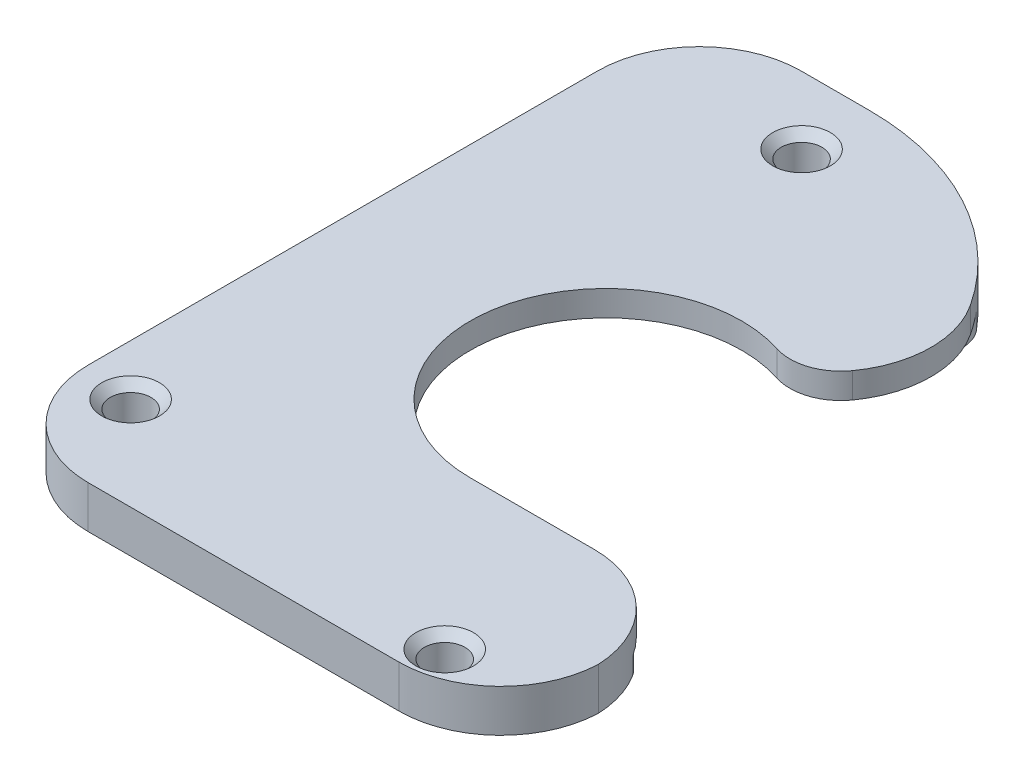
ISO-10303-21;
HEADER;
FILE_DESCRIPTION(('STEP AP214'),'2;1');
FILE_NAME('part.step','',(''),(''),'','','');
FILE_SCHEMA(('AUTOMOTIVE_DESIGN { 1 0 10303 214 1 1 1 1 }'));
ENDSEC;
DATA;
#1=APPLICATION_CONTEXT('core data for automotive mechanical design processes');
#2=APPLICATION_PROTOCOL_DEFINITION('international standard','automotive_design',2000,#1);
#3=PRODUCT_CONTEXT('',#1,'mechanical');
#4=PRODUCT('Part','Part','',(#3));
#5=PRODUCT_RELATED_PRODUCT_CATEGORY('part','',(#4));
#6=PRODUCT_DEFINITION_FORMATION('','',#4);
#7=PRODUCT_DEFINITION_CONTEXT('part definition',#1,'design');
#8=PRODUCT_DEFINITION('design','',#6,#7);
#9=PRODUCT_DEFINITION_SHAPE('','',#8);
#10=(LENGTH_UNIT() NAMED_UNIT(*) SI_UNIT(.MILLI.,.METRE.));
#11=(NAMED_UNIT(*) PLANE_ANGLE_UNIT() SI_UNIT($,.RADIAN.));
#12=(NAMED_UNIT(*) SI_UNIT($,.STERADIAN.) SOLID_ANGLE_UNIT());
#13=UNCERTAINTY_MEASURE_WITH_UNIT(LENGTH_MEASURE(1.E-05),#10,'distance_accuracy_value','');
#14=(GEOMETRIC_REPRESENTATION_CONTEXT(3) GLOBAL_UNCERTAINTY_ASSIGNED_CONTEXT((#13)) GLOBAL_UNIT_ASSIGNED_CONTEXT((#10,
#11,#12)) REPRESENTATION_CONTEXT('',''));
#15=CARTESIAN_POINT('',(0.,0.,0.));
#16=DIRECTION('',(0.,0.,1.));
#17=DIRECTION('',(1.,0.,0.));
#18=AXIS2_PLACEMENT_3D('',#15,#16,#17);
#19=CARTESIAN_POINT('',(0.,2.5,8.));
#20=DIRECTION('',(0.,0.,1.));
#21=DIRECTION('',(1.,0.,0.));
#22=AXIS2_PLACEMENT_3D('',#19,#20,#21);
#23=PLANE('',#22);
#24=DIRECTION('',(1.,0.,0.));
#25=VECTOR('',#24,1.);
#26=CARTESIAN_POINT('',(0.,1.,8.));
#27=LINE('',#26,#25);
#28=CARTESIAN_POINT('',(0.,1.,8.));
#29=VERTEX_POINT('',#28);
#30=CARTESIAN_POINT('',(7.30000000000001,1.,8.));
#31=VERTEX_POINT('',#30);
#32=EDGE_CURVE('E169',#29,#31,#27,.T.);
#33=ORIENTED_EDGE('',*,*,#32,.F.);
#34=DIRECTION('',(0.,-1.,0.));
#35=VECTOR('',#34,1.);
#36=CARTESIAN_POINT('',(0.,2.5,8.));
#37=LINE('',#36,#35);
#38=CARTESIAN_POINT('',(0.,2.5,8.));
#39=VERTEX_POINT('',#38);
#40=EDGE_CURVE('E168',#39,#29,#37,.T.);
#41=ORIENTED_EDGE('',*,*,#40,.F.);
#42=DIRECTION('',(-1.,0.,0.));
#43=VECTOR('',#42,1.);
#44=CARTESIAN_POINT('',(0.,2.5,8.));
#45=LINE('',#44,#43);
#46=CARTESIAN_POINT('',(7.30000000000001,2.5,8.));
#47=VERTEX_POINT('',#46);
#48=EDGE_CURVE('E310',#47,#39,#45,.T.);
#49=ORIENTED_EDGE('',*,*,#48,.F.);
#50=DIRECTION('',(0.,-1.,0.));
#51=VECTOR('',#50,1.);
#52=CARTESIAN_POINT('',(7.30000000000001,2.5,8.));
#53=LINE('',#52,#51);
#54=EDGE_CURVE('E360',#47,#31,#53,.T.);
#55=ORIENTED_EDGE('',*,*,#54,.T.);
#56=EDGE_LOOP('',(#33,#41,#49,#55));
#57=FACE_BOUND('',#56,.T.);
#58=ADVANCED_FACE('F37',(#57),#23,.F.);
#59=CARTESIAN_POINT('',(0.,2.5,0.));
#60=DIRECTION('',(0.,-1.,0.));
#61=DIRECTION('',(0.,0.,-1.));
#62=AXIS2_PLACEMENT_3D('',#59,#60,#61);
#63=CYLINDRICAL_SURFACE('',#62,8.);
#64=CARTESIAN_POINT('',(0.,1.,0.));
#65=DIRECTION('',(0.,-1.,0.));
#66=DIRECTION('',(0.,0.,-1.));
#67=AXIS2_PLACEMENT_3D('',#64,#65,#66);
#68=CIRCLE('',#67,8.);
#69=CARTESIAN_POINT('',(2.44412412371612,1.,-7.6174967848939));
#70=VERTEX_POINT('',#69);
#71=EDGE_CURVE('E153',#70,#29,#68,.F.);
#72=ORIENTED_EDGE('',*,*,#71,.F.);
#73=DIRECTION('',(0.,-1.,0.));
#74=VECTOR('',#73,1.);
#75=CARTESIAN_POINT('',(2.44412412371612,2.5,-7.6174967848939));
#76=LINE('',#75,#74);
#77=CARTESIAN_POINT('',(2.44412412371612,2.5,-7.6174967848939));
#78=VERTEX_POINT('',#77);
#79=EDGE_CURVE('E165',#70,#78,#76,.F.);
#80=ORIENTED_EDGE('',*,*,#79,.T.);
#81=CARTESIAN_POINT('',(0.,2.5,0.));
#82=DIRECTION('',(0.,-1.,0.));
#83=DIRECTION('',(0.,0.,1.));
#84=AXIS2_PLACEMENT_3D('',#81,#82,#83);
#85=CIRCLE('',#84,8.);
#86=EDGE_CURVE('E312',#39,#78,#85,.T.);
#87=ORIENTED_EDGE('',*,*,#86,.F.);
#88=ORIENTED_EDGE('',*,*,#40,.T.);
#89=EDGE_LOOP('',(#72,#80,#87,#88));
#90=FACE_BOUND('',#89,.T.);
#91=ADVANCED_FACE('F163',(#90),#63,.F.);
#92=CARTESIAN_POINT('',(3.36067067010967,2.5,-10.4740580792291));
#93=DIRECTION('',(0.,1.,0.));
#94=DIRECTION('',(0.,0.,1.));
#95=AXIS2_PLACEMENT_3D('',#92,#93,#94);
#96=CYLINDRICAL_SURFACE('',#95,3.);
#97=ORIENTED_EDGE('',*,*,#79,.F.);
#98=CARTESIAN_POINT('',(3.36067067010967,1.,-10.4740580792291));
#99=DIRECTION('',(0.,-1.,0.));
#100=DIRECTION('',(0.,0.,-1.));
#101=AXIS2_PLACEMENT_3D('',#98,#99,#100);
#102=CIRCLE('',#101,3.);
#103=CARTESIAN_POINT('',(5.79591698377834,1.,-8.72203770498594));
#104=VERTEX_POINT('',#103);
#105=EDGE_CURVE('E150',#70,#104,#102,.F.);
#106=ORIENTED_EDGE('',*,*,#105,.T.);
#107=DIRECTION('',(0.,1.,0.));
#108=VECTOR('',#107,1.);
#109=CARTESIAN_POINT('',(5.79591698377834,2.5,-8.72203770498594));
#110=LINE('',#109,#108);
#111=CARTESIAN_POINT('',(5.79591698377834,2.5,-8.72203770498594));
#112=VERTEX_POINT('',#111);
#113=EDGE_CURVE('E173',#112,#104,#110,.F.);
#114=ORIENTED_EDGE('',*,*,#113,.F.);
#115=CARTESIAN_POINT('',(3.36067067010967,2.5,-10.4740580792291));
#116=DIRECTION('',(0.,1.,0.));
#117=DIRECTION('',(0.,0.,1.));
#118=AXIS2_PLACEMENT_3D('',#115,#116,#117);
#119=CIRCLE('',#118,3.);
#120=EDGE_CURVE('E159',#78,#112,#119,.T.);
#121=ORIENTED_EDGE('',*,*,#120,.F.);
#122=EDGE_LOOP('',(#97,#106,#114,#121));
#123=FACE_BOUND('',#122,.T.);
#124=ADVANCED_FACE('F172',(#123),#96,.T.);
#125=CARTESIAN_POINT('',(-7.,2.5,-7.01471163744065));
#126=DIRECTION('',(0.,-1.,0.));
#127=DIRECTION('',(0.,0.,-1.));
#128=AXIS2_PLACEMENT_3D('',#125,#126,#127);
#129=CYLINDRICAL_SURFACE('',#128,15.4852883625594);
#130=DIRECTION('',(0.,-1.,0.));
#131=VECTOR('',#130,1.);
#132=CARTESIAN_POINT('',(5.93871908413183,2.5,-15.5225729511633));
#133=LINE('',#132,#131);
#134=CARTESIAN_POINT('',(5.93871908413183,2.5,-15.5225729511633));
#135=VERTEX_POINT('',#134);
#136=CARTESIAN_POINT('',(5.93871908413183,1.,-15.5225729511633));
#137=VERTEX_POINT('',#136);
#138=EDGE_CURVE('E339',#135,#137,#133,.T.);
#139=ORIENTED_EDGE('',*,*,#138,.T.);
#140=CARTESIAN_POINT('',(-7.,1.,-7.01471163744065));
#141=DIRECTION('',(0.,-1.,0.));
#142=DIRECTION('',(0.,0.,-1.));
#143=AXIS2_PLACEMENT_3D('',#140,#141,#142);
#144=CIRCLE('',#143,15.4852883625594);
#145=CARTESIAN_POINT('',(4.90136228982585,1.,-16.9218671988481));
#146=VERTEX_POINT('',#145);
#147=EDGE_CURVE('E194',#137,#146,#144,.F.);
#148=ORIENTED_EDGE('',*,*,#147,.T.);
#149=DIRECTION('',(0.,-1.,0.));
#150=VECTOR('',#149,1.);
#151=CARTESIAN_POINT('',(4.90136228982585,2.5,-16.9218671988481));
#152=LINE('',#151,#150);
#153=CARTESIAN_POINT('',(4.90136228982585,0.,-16.9218671988481));
#154=VERTEX_POINT('',#153);
#155=EDGE_CURVE('E192',#146,#154,#152,.T.);
#156=ORIENTED_EDGE('',*,*,#155,.T.);
#157=CARTESIAN_POINT('',(-7.,0.,-7.01471163744065));
#158=DIRECTION('',(0.,1.,0.));
#159=DIRECTION('',(0.,0.,1.));
#160=AXIS2_PLACEMENT_3D('',#157,#158,#159);
#161=CIRCLE('',#160,15.4852883625594);
#162=CARTESIAN_POINT('',(-7.,0.,-22.5));
#163=VERTEX_POINT('',#162);
#164=EDGE_CURVE('E287',#154,#163,#161,.T.);
#165=ORIENTED_EDGE('',*,*,#164,.T.);
#166=DIRECTION('',(0.,-1.,0.));
#167=VECTOR('',#166,1.);
#168=CARTESIAN_POINT('',(-7.,2.5,-22.5));
#169=LINE('',#168,#167);
#170=CARTESIAN_POINT('',(-7.,2.5,-22.5));
#171=VERTEX_POINT('',#170);
#172=EDGE_CURVE('E326',#171,#163,#169,.T.);
#173=ORIENTED_EDGE('',*,*,#172,.F.);
#174=CARTESIAN_POINT('',(-7.,2.5,-7.01471163744065));
#175=DIRECTION('',(0.,1.,0.));
#176=DIRECTION('',(0.,0.,1.));
#177=AXIS2_PLACEMENT_3D('',#174,#175,#176);
#178=CIRCLE('',#177,15.4852883625594);
#179=EDGE_CURVE('E315',#135,#171,#178,.T.);
#180=ORIENTED_EDGE('',*,*,#179,.F.);
#181=EDGE_LOOP('',(#139,#148,#156,#165,#173,#180));
#182=FACE_BOUND('',#181,.T.);
#183=ADVANCED_FACE('F261',(#182),#129,.T.);
#184=CARTESIAN_POINT('',(-17.,2.5,-22.5));
#185=DIRECTION('',(0.,0.,1.));
#186=DIRECTION('',(1.,0.,0.));
#187=AXIS2_PLACEMENT_3D('',#184,#185,#186);
#188=PLANE('',#187);
#189=DIRECTION('',(-1.,0.,0.));
#190=VECTOR('',#189,1.);
#191=CARTESIAN_POINT('',(-17.,0.,-22.5));
#192=LINE('',#191,#190);
#193=CARTESIAN_POINT('',(-11.,0.,-22.5));
#194=VERTEX_POINT('',#193);
#195=EDGE_CURVE('E328',#163,#194,#192,.T.);
#196=ORIENTED_EDGE('',*,*,#195,.T.);
#197=DIRECTION('',(0.,-1.,0.));
#198=VECTOR('',#197,1.);
#199=CARTESIAN_POINT('',(-11.,2.5,-22.5));
#200=LINE('',#199,#198);
#201=CARTESIAN_POINT('',(-11.,2.5,-22.5));
#202=VERTEX_POINT('',#201);
#203=EDGE_CURVE('E176',#194,#202,#200,.F.);
#204=ORIENTED_EDGE('',*,*,#203,.T.);
#205=DIRECTION('',(-1.,0.,0.));
#206=VECTOR('',#205,1.);
#207=CARTESIAN_POINT('',(-17.,2.5,-22.5));
#208=LINE('',#207,#206);
#209=EDGE_CURVE('E317',#171,#202,#208,.T.);
#210=ORIENTED_EDGE('',*,*,#209,.F.);
#211=ORIENTED_EDGE('',*,*,#172,.T.);
#212=EDGE_LOOP('',(#196,#204,#210,#211));
#213=FACE_BOUND('',#212,.T.);
#214=ADVANCED_FACE('F397',(#213),#188,.F.);
#215=CARTESIAN_POINT('',(-17.,2.5,-22.5));
#216=DIRECTION('',(1.,0.,0.));
#217=DIRECTION('',(0.,0.,-1.));
#218=AXIS2_PLACEMENT_3D('',#215,#216,#217);
#219=PLANE('',#218);
#220=DIRECTION('',(0.,0.,1.));
#221=VECTOR('',#220,1.);
#222=CARTESIAN_POINT('',(-17.,2.5,-22.5));
#223=LINE('',#222,#221);
#224=CARTESIAN_POINT('',(-17.,2.5,-16.5));
#225=VERTEX_POINT('',#224);
#226=CARTESIAN_POINT('',(-17.,2.5,13.5));
#227=VERTEX_POINT('',#226);
#228=EDGE_CURVE('E320',#225,#227,#223,.T.);
#229=ORIENTED_EDGE('',*,*,#228,.F.);
#230=DIRECTION('',(0.,-1.,0.));
#231=VECTOR('',#230,1.);
#232=CARTESIAN_POINT('',(-17.,2.5,-16.5));
#233=LINE('',#232,#231);
#234=CARTESIAN_POINT('',(-17.,0.,-16.5));
#235=VERTEX_POINT('',#234);
#236=EDGE_CURVE('E370',#225,#235,#233,.T.);
#237=ORIENTED_EDGE('',*,*,#236,.T.);
#238=DIRECTION('',(0.,0.,1.));
#239=VECTOR('',#238,1.);
#240=CARTESIAN_POINT('',(-17.,0.,-22.5));
#241=LINE('',#240,#239);
#242=CARTESIAN_POINT('',(-17.,0.,13.5));
#243=VERTEX_POINT('',#242);
#244=EDGE_CURVE('E331',#235,#243,#241,.T.);
#245=ORIENTED_EDGE('',*,*,#244,.T.);
#246=DIRECTION('',(0.,-1.,0.));
#247=VECTOR('',#246,1.);
#248=CARTESIAN_POINT('',(-17.,2.5,13.5));
#249=LINE('',#248,#247);
#250=EDGE_CURVE('E368',#243,#227,#249,.F.);
#251=ORIENTED_EDGE('',*,*,#250,.T.);
#252=EDGE_LOOP('',(#229,#237,#245,#251));
#253=FACE_BOUND('',#252,.T.);
#254=ADVANCED_FACE('F392',(#253),#219,.F.);
#255=CARTESIAN_POINT('',(-17.,2.5,19.5));
#256=DIRECTION('',(0.,0.,-1.));
#257=DIRECTION('',(-1.,0.,0.));
#258=AXIS2_PLACEMENT_3D('',#255,#256,#257);
#259=PLANE('',#258);
#260=DIRECTION('',(1.,0.,0.));
#261=VECTOR('',#260,1.);
#262=CARTESIAN_POINT('',(-17.,0.,19.5));
#263=LINE('',#262,#261);
#264=CARTESIAN_POINT('',(-11.,0.,19.5));
#265=VERTEX_POINT('',#264);
#266=CARTESIAN_POINT('',(7.3,0.,19.5));
#267=VERTEX_POINT('',#266);
#268=EDGE_CURVE('E313',#265,#267,#263,.T.);
#269=ORIENTED_EDGE('',*,*,#268,.T.);
#270=DIRECTION('',(0.,-1.,0.));
#271=VECTOR('',#270,1.);
#272=CARTESIAN_POINT('',(7.30000000000001,2.5,19.5));
#273=LINE('',#272,#271);
#274=CARTESIAN_POINT('',(7.3,2.5,19.5));
#275=VERTEX_POINT('',#274);
#276=EDGE_CURVE('E366',#267,#275,#273,.F.);
#277=ORIENTED_EDGE('',*,*,#276,.T.);
#278=DIRECTION('',(1.,0.,0.));
#279=VECTOR('',#278,1.);
#280=CARTESIAN_POINT('',(-17.,2.5,19.5));
#281=LINE('',#280,#279);
#282=CARTESIAN_POINT('',(-11.,2.5,19.5));
#283=VERTEX_POINT('',#282);
#284=EDGE_CURVE('E323',#283,#275,#281,.T.);
#285=ORIENTED_EDGE('',*,*,#284,.F.);
#286=DIRECTION('',(0.,-1.,0.));
#287=VECTOR('',#286,1.);
#288=CARTESIAN_POINT('',(-11.,2.5,19.5));
#289=LINE('',#288,#287);
#290=EDGE_CURVE('E363',#283,#265,#289,.T.);
#291=ORIENTED_EDGE('',*,*,#290,.T.);
#292=EDGE_LOOP('',(#269,#277,#285,#291));
#293=FACE_BOUND('',#292,.T.);
#294=ADVANCED_FACE('F384',(#293),#259,.F.);
#295=CARTESIAN_POINT('',(-7.,2.5,-7.01471163744065));
#296=DIRECTION('',(0.,1.,0.));
#297=DIRECTION('',(0.,0.,1.));
#298=AXIS2_PLACEMENT_3D('',#295,#296,#297);
#299=PLANE('',#298);
#300=CARTESIAN_POINT('',(8.,2.5,17.5));
#301=DIRECTION('',(0.,1.,0.));
#302=DIRECTION('',(0.,0.,1.));
#303=AXIS2_PLACEMENT_3D('',#300,#301,#302);
#304=CIRCLE('',#303,1.70000000000001);
#305=CARTESIAN_POINT('',(8.,2.5,19.2));
#306=VERTEX_POINT('',#305);
#307=EDGE_CURVE('E208',#306,#306,#304,.F.);
#308=ORIENTED_EDGE('',*,*,#307,.T.);
#309=EDGE_LOOP('',(#308));
#310=FACE_BOUND('',#309,.T.);
#311=CARTESIAN_POINT('',(-14.,2.5,14.));
#312=DIRECTION('',(0.,1.,0.));
#313=DIRECTION('',(0.,0.,1.));
#314=AXIS2_PLACEMENT_3D('',#311,#312,#313);
#315=CIRCLE('',#314,1.70000000000001);
#316=CARTESIAN_POINT('',(-14.,2.5,15.7));
#317=VERTEX_POINT('',#316);
#318=EDGE_CURVE('E205',#317,#317,#315,.F.);
#319=ORIENTED_EDGE('',*,*,#318,.T.);
#320=EDGE_LOOP('',(#319));
#321=FACE_BOUND('',#320,.T.);
#322=CARTESIAN_POINT('',(-7.,2.5,-18.5213390444644));
#323=DIRECTION('',(0.,1.,0.));
#324=DIRECTION('',(0.,0.,1.));
#325=AXIS2_PLACEMENT_3D('',#322,#323,#324);
#326=CIRCLE('',#325,1.70000000000001);
#327=CARTESIAN_POINT('',(-7.,2.5,-16.8213390444644));
#328=VERTEX_POINT('',#327);
#329=EDGE_CURVE('E202',#328,#328,#326,.F.);
#330=ORIENTED_EDGE('',*,*,#329,.T.);
#331=EDGE_LOOP('',(#330));
#332=FACE_BOUND('',#331,.T.);
#333=ORIENTED_EDGE('',*,*,#86,.T.);
#334=ORIENTED_EDGE('',*,*,#120,.T.);
#335=CARTESIAN_POINT('',(0.925424356441002,2.5,-12.2260784534723));
#336=DIRECTION('',(0.,1.,0.));
#337=DIRECTION('',(0.,0.,1.));
#338=AXIS2_PLACEMENT_3D('',#335,#336,#337);
#339=CIRCLE('',#338,6.);
#340=EDGE_CURVE('E358',#112,#135,#339,.T.);
#341=ORIENTED_EDGE('',*,*,#340,.T.);
#342=ORIENTED_EDGE('',*,*,#179,.T.);
#343=ORIENTED_EDGE('',*,*,#209,.T.);
#344=CARTESIAN_POINT('',(-11.,2.5,-16.5));
#345=DIRECTION('',(0.,1.,0.));
#346=DIRECTION('',(0.,0.,1.));
#347=AXIS2_PLACEMENT_3D('',#344,#345,#346);
#348=CIRCLE('',#347,6.);
#349=EDGE_CURVE('E352',#202,#225,#348,.T.);
#350=ORIENTED_EDGE('',*,*,#349,.T.);
#351=ORIENTED_EDGE('',*,*,#228,.T.);
#352=CARTESIAN_POINT('',(-11.,2.5,13.5));
#353=DIRECTION('',(0.,1.,0.));
#354=DIRECTION('',(0.,0.,1.));
#355=AXIS2_PLACEMENT_3D('',#352,#353,#354);
#356=CIRCLE('',#355,6.);
#357=EDGE_CURVE('E350',#227,#283,#356,.T.);
#358=ORIENTED_EDGE('',*,*,#357,.T.);
#359=ORIENTED_EDGE('',*,*,#284,.T.);
#360=CARTESIAN_POINT('',(7.30000000000001,2.5,13.5));
#361=DIRECTION('',(0.,1.,0.));
#362=DIRECTION('',(0.,0.,1.));
#363=AXIS2_PLACEMENT_3D('',#360,#361,#362);
#364=CIRCLE('',#363,6.);
#365=CARTESIAN_POINT('',(13.2947894041409,2.5,13.75));
#366=VERTEX_POINT('',#365);
#367=EDGE_CURVE('E354',#275,#366,#364,.T.);
#368=ORIENTED_EDGE('',*,*,#367,.T.);
#369=CARTESIAN_POINT('',(7.30000000000001,2.5,14.));
#370=DIRECTION('',(0.,1.,0.));
#371=DIRECTION('',(0.,0.,1.));
#372=AXIS2_PLACEMENT_3D('',#369,#370,#371);
#373=CIRCLE('',#372,6.);
#374=EDGE_CURVE('E356',#366,#47,#373,.T.);
#375=ORIENTED_EDGE('',*,*,#374,.T.);
#376=ORIENTED_EDGE('',*,*,#48,.T.);
#377=EDGE_LOOP('',(#333,#334,#341,#342,#343,#350,#351,#358,#359,#368,#375,#376));
#378=FACE_BOUND('',#377,.T.);
#379=ADVANCED_FACE('F404',(#310,#321,#332,#378),#299,.T.);
#380=CARTESIAN_POINT('',(-7.,0.,-7.01471163744065));
#381=DIRECTION('',(0.,1.,0.));
#382=DIRECTION('',(0.,0.,1.));
#383=AXIS2_PLACEMENT_3D('',#380,#381,#382);
#384=PLANE('',#383);
#385=CARTESIAN_POINT('',(-14.,0.,14.));
#386=DIRECTION('',(0.,1.,0.));
#387=DIRECTION('',(0.,0.,1.));
#388=AXIS2_PLACEMENT_3D('',#385,#386,#387);
#389=CIRCLE('',#388,1.2);
#390=CARTESIAN_POINT('',(-14.,0.,15.2));
#391=VERTEX_POINT('',#390);
#392=EDGE_CURVE('E301',#391,#391,#389,.T.);
#393=ORIENTED_EDGE('',*,*,#392,.T.);
#394=EDGE_LOOP('',(#393));
#395=FACE_BOUND('',#394,.T.);
#396=CARTESIAN_POINT('',(-7.,0.,-18.5213390444644));
#397=DIRECTION('',(0.,1.,0.));
#398=DIRECTION('',(0.,0.,1.));
#399=AXIS2_PLACEMENT_3D('',#396,#397,#398);
#400=CIRCLE('',#399,1.2);
#401=CARTESIAN_POINT('',(-7.,0.,-17.3213390444644));
#402=VERTEX_POINT('',#401);
#403=EDGE_CURVE('E304',#402,#402,#400,.T.);
#404=ORIENTED_EDGE('',*,*,#403,.T.);
#405=EDGE_LOOP('',(#404));
#406=FACE_BOUND('',#405,.T.);
#407=CARTESIAN_POINT('',(8.,0.,17.5));
#408=DIRECTION('',(0.,1.,0.));
#409=DIRECTION('',(0.,0.,1.));
#410=AXIS2_PLACEMENT_3D('',#407,#408,#409);
#411=CIRCLE('',#410,1.2);
#412=CARTESIAN_POINT('',(8.,0.,18.7));
#413=VERTEX_POINT('',#412);
#414=EDGE_CURVE('E307',#413,#413,#411,.T.);
#415=ORIENTED_EDGE('',*,*,#414,.T.);
#416=EDGE_LOOP('',(#415));
#417=FACE_BOUND('',#416,.T.);
#418=CARTESIAN_POINT('',(0.,0.,0.));
#419=DIRECTION('',(0.,-1.,0.));
#420=DIRECTION('',(0.,0.,-1.));
#421=AXIS2_PLACEMENT_3D('',#418,#419,#420);
#422=CIRCLE('',#421,14.);
#423=CARTESIAN_POINT('',(9.36351915395025,0.,10.4079060840117));
#424=VERTEX_POINT('',#423);
#425=CARTESIAN_POINT('',(2.94371323926591,0.,-13.6870213108978));
#426=VERTEX_POINT('',#425);
#427=EDGE_CURVE('E285',#424,#426,#422,.T.);
#428=ORIENTED_EDGE('',*,*,#427,.F.);
#429=CARTESIAN_POINT('',(10.7011647473717,0.,11.894749810299));
#430=DIRECTION('',(0.,1.,0.));
#431=DIRECTION('',(0.,0.,1.));
#432=AXIS2_PLACEMENT_3D('',#429,#430,#431);
#433=CIRCLE('',#432,2.);
#434=CARTESIAN_POINT('',(12.4017471210576,0.,10.8421247154485));
#435=VERTEX_POINT('',#434);
#436=EDGE_CURVE('E187',#424,#435,#433,.F.);
#437=ORIENTED_EDGE('',*,*,#436,.T.);
#438=CARTESIAN_POINT('',(7.30000000000001,0.,14.));
#439=DIRECTION('',(0.,1.,0.));
#440=DIRECTION('',(0.,0.,1.));
#441=AXIS2_PLACEMENT_3D('',#438,#439,#440);
#442=CIRCLE('',#441,6.);
#443=CARTESIAN_POINT('',(13.2947894041409,0.,13.75));
#444=VERTEX_POINT('',#443);
#445=EDGE_CURVE('E348',#435,#444,#442,.F.);
#446=ORIENTED_EDGE('',*,*,#445,.T.);
#447=CARTESIAN_POINT('',(7.30000000000001,0.,13.5));
#448=DIRECTION('',(0.,1.,0.));
#449=DIRECTION('',(0.,0.,1.));
#450=AXIS2_PLACEMENT_3D('',#447,#448,#449);
#451=CIRCLE('',#450,6.);
#452=EDGE_CURVE('E346',#444,#267,#451,.F.);
#453=ORIENTED_EDGE('',*,*,#452,.T.);
#454=ORIENTED_EDGE('',*,*,#268,.F.);
#455=CARTESIAN_POINT('',(-11.,0.,13.5));
#456=DIRECTION('',(0.,1.,0.));
#457=DIRECTION('',(0.,0.,1.));
#458=AXIS2_PLACEMENT_3D('',#455,#456,#457);
#459=CIRCLE('',#458,6.);
#460=EDGE_CURVE('E342',#265,#243,#459,.F.);
#461=ORIENTED_EDGE('',*,*,#460,.T.);
#462=ORIENTED_EDGE('',*,*,#244,.F.);
#463=CARTESIAN_POINT('',(-11.,0.,-16.5));
#464=DIRECTION('',(0.,1.,0.));
#465=DIRECTION('',(0.,0.,1.));
#466=AXIS2_PLACEMENT_3D('',#463,#464,#465);
#467=CIRCLE('',#466,6.);
#468=EDGE_CURVE('E344',#235,#194,#467,.F.);
#469=ORIENTED_EDGE('',*,*,#468,.T.);
#470=ORIENTED_EDGE('',*,*,#195,.F.);
#471=ORIENTED_EDGE('',*,*,#164,.F.);
#472=CARTESIAN_POINT('',(3.36424370201818,0.,-15.6423100695975));
#473=DIRECTION('',(0.,1.,0.));
#474=DIRECTION('',(0.,0.,1.));
#475=AXIS2_PLACEMENT_3D('',#472,#473,#474);
#476=CIRCLE('',#475,2.);
#477=EDGE_CURVE('E185',#154,#426,#476,.F.);
#478=ORIENTED_EDGE('',*,*,#477,.T.);
#479=EDGE_LOOP('',(#428,#437,#446,#453,#454,#461,#462,#469,#470,#471,#478));
#480=FACE_BOUND('',#479,.T.);
#481=ADVANCED_FACE('F284',(#395,#406,#417,#480),#384,.F.);
#482=CARTESIAN_POINT('',(8.,0.,17.5));
#483=DIRECTION('',(0.,1.,0.));
#484=DIRECTION('',(0.,0.,1.));
#485=AXIS2_PLACEMENT_3D('',#482,#483,#484);
#486=CYLINDRICAL_SURFACE('',#485,1.2);
#487=CARTESIAN_POINT('',(8.,2.,17.5));
#488=DIRECTION('',(0.,1.,0.));
#489=DIRECTION('',(0.,0.,1.));
#490=AXIS2_PLACEMENT_3D('',#487,#488,#489);
#491=CIRCLE('',#490,1.2);
#492=CARTESIAN_POINT('',(8.,2.,18.7));
#493=VERTEX_POINT('',#492);
#494=EDGE_CURVE('E199',#493,#493,#491,.T.);
#495=ORIENTED_EDGE('',*,*,#494,.T.);
#496=EDGE_LOOP('',(#495));
#497=FACE_BOUND('',#496,.T.);
#498=ORIENTED_EDGE('',*,*,#414,.F.);
#499=EDGE_LOOP('',(#498));
#500=FACE_BOUND('',#499,.T.);
#501=ADVANCED_FACE('F414',(#497,#500),#486,.F.);
#502=CARTESIAN_POINT('',(-7.,0.,-18.5213390444644));
#503=DIRECTION('',(0.,1.,0.));
#504=DIRECTION('',(0.,0.,1.));
#505=AXIS2_PLACEMENT_3D('',#502,#503,#504);
#506=CYLINDRICAL_SURFACE('',#505,1.2);
#507=CARTESIAN_POINT('',(-7.,2.,-18.5213390444644));
#508=DIRECTION('',(0.,1.,0.));
#509=DIRECTION('',(0.,0.,1.));
#510=AXIS2_PLACEMENT_3D('',#507,#508,#509);
#511=CIRCLE('',#510,1.2);
#512=CARTESIAN_POINT('',(-7.,2.,-17.3213390444644));
#513=VERTEX_POINT('',#512);
#514=EDGE_CURVE('E11',#513,#513,#511,.T.);
#515=ORIENTED_EDGE('',*,*,#514,.T.);
#516=EDGE_LOOP('',(#515));
#517=FACE_BOUND('',#516,.T.);
#518=ORIENTED_EDGE('',*,*,#403,.F.);
#519=EDGE_LOOP('',(#518));
#520=FACE_BOUND('',#519,.T.);
#521=ADVANCED_FACE('F527',(#517,#520),#506,.F.);
#522=CARTESIAN_POINT('',(-14.,0.,14.));
#523=DIRECTION('',(0.,1.,0.));
#524=DIRECTION('',(0.,0.,1.));
#525=AXIS2_PLACEMENT_3D('',#522,#523,#524);
#526=CYLINDRICAL_SURFACE('',#525,1.2);
#527=CARTESIAN_POINT('',(-14.,2.,14.));
#528=DIRECTION('',(0.,1.,0.));
#529=DIRECTION('',(0.,0.,1.));
#530=AXIS2_PLACEMENT_3D('',#527,#528,#529);
#531=CIRCLE('',#530,1.2);
#532=CARTESIAN_POINT('',(-14.,2.,15.2));
#533=VERTEX_POINT('',#532);
#534=EDGE_CURVE('E46',#533,#533,#531,.T.);
#535=ORIENTED_EDGE('',*,*,#534,.T.);
#536=EDGE_LOOP('',(#535));
#537=FACE_BOUND('',#536,.T.);
#538=ORIENTED_EDGE('',*,*,#392,.F.);
#539=EDGE_LOOP('',(#538));
#540=FACE_BOUND('',#539,.T.);
#541=ADVANCED_FACE('F213',(#537,#540),#526,.F.);
#542=CARTESIAN_POINT('',(0.925424356441002,2.5,-12.2260784534723));
#543=DIRECTION('',(0.,1.,0.));
#544=DIRECTION('',(0.,0.,1.));
#545=AXIS2_PLACEMENT_3D('',#542,#543,#544);
#546=CYLINDRICAL_SURFACE('',#545,6.);
#547=CARTESIAN_POINT('',(0.925424356441002,1.,-12.2260784534723));
#548=DIRECTION('',(0.,-1.,0.));
#549=DIRECTION('',(0.,0.,-1.));
#550=AXIS2_PLACEMENT_3D('',#547,#548,#549);
#551=CIRCLE('',#550,6.);
#552=EDGE_CURVE('E53',#104,#137,#551,.F.);
#553=ORIENTED_EDGE('',*,*,#552,.T.);
#554=ORIENTED_EDGE('',*,*,#138,.F.);
#555=ORIENTED_EDGE('',*,*,#340,.F.);
#556=ORIENTED_EDGE('',*,*,#113,.T.);
#557=EDGE_LOOP('',(#553,#554,#555,#556));
#558=FACE_BOUND('',#557,.T.);
#559=ADVANCED_FACE('F239',(#558),#546,.T.);
#560=CARTESIAN_POINT('',(7.30000000000001,2.5,13.5));
#561=DIRECTION('',(0.,-1.,0.));
#562=DIRECTION('',(0.,0.,-1.));
#563=AXIS2_PLACEMENT_3D('',#560,#561,#562);
#564=CYLINDRICAL_SURFACE('',#563,6.);
#565=DIRECTION('',(0.,-1.,0.));
#566=VECTOR('',#565,1.);
#567=CARTESIAN_POINT('',(13.2947894041409,1.25,13.75));
#568=LINE('',#567,#566);
#569=EDGE_CURVE('E300',#366,#444,#568,.T.);
#570=ORIENTED_EDGE('',*,*,#569,.F.);
#571=ORIENTED_EDGE('',*,*,#367,.F.);
#572=ORIENTED_EDGE('',*,*,#276,.F.);
#573=ORIENTED_EDGE('',*,*,#452,.F.);
#574=EDGE_LOOP('',(#570,#571,#572,#573));
#575=FACE_BOUND('',#574,.T.);
#576=ADVANCED_FACE('F242',(#575),#564,.T.);
#577=CARTESIAN_POINT('',(7.30000000000001,2.5,14.));
#578=DIRECTION('',(0.,-1.,0.));
#579=DIRECTION('',(0.,0.,-1.));
#580=AXIS2_PLACEMENT_3D('',#577,#578,#579);
#581=CYLINDRICAL_SURFACE('',#580,6.);
#582=ORIENTED_EDGE('',*,*,#445,.F.);
#583=DIRECTION('',(0.,-1.,0.));
#584=VECTOR('',#583,1.);
#585=CARTESIAN_POINT('',(12.4017471210576,2.5,10.8421247154485));
#586=LINE('',#585,#584);
#587=CARTESIAN_POINT('',(12.4017471210576,1.,10.8421247154485));
#588=VERTEX_POINT('',#587);
#589=EDGE_CURVE('E189',#435,#588,#586,.F.);
#590=ORIENTED_EDGE('',*,*,#589,.T.);
#591=CARTESIAN_POINT('',(7.30000000000001,1.,14.));
#592=DIRECTION('',(0.,-1.,0.));
#593=DIRECTION('',(0.,0.,-1.));
#594=AXIS2_PLACEMENT_3D('',#591,#592,#593);
#595=CIRCLE('',#594,6.);
#596=EDGE_CURVE('E297',#588,#31,#595,.F.);
#597=ORIENTED_EDGE('',*,*,#596,.T.);
#598=ORIENTED_EDGE('',*,*,#54,.F.);
#599=ORIENTED_EDGE('',*,*,#374,.F.);
#600=ORIENTED_EDGE('',*,*,#569,.T.);
#601=EDGE_LOOP('',(#582,#590,#597,#598,#599,#600));
#602=FACE_BOUND('',#601,.T.);
#603=ADVANCED_FACE('F243',(#602),#581,.T.);
#604=CARTESIAN_POINT('',(-11.,2.5,-16.5));
#605=DIRECTION('',(0.,-1.,0.));
#606=DIRECTION('',(0.,0.,-1.));
#607=AXIS2_PLACEMENT_3D('',#604,#605,#606);
#608=CYLINDRICAL_SURFACE('',#607,6.);
#609=ORIENTED_EDGE('',*,*,#349,.F.);
#610=ORIENTED_EDGE('',*,*,#203,.F.);
#611=ORIENTED_EDGE('',*,*,#468,.F.);
#612=ORIENTED_EDGE('',*,*,#236,.F.);
#613=EDGE_LOOP('',(#609,#610,#611,#612));
#614=FACE_BOUND('',#613,.T.);
#615=ADVANCED_FACE('F246',(#614),#608,.T.);
#616=CARTESIAN_POINT('',(-11.,2.5,13.5));
#617=DIRECTION('',(0.,-1.,0.));
#618=DIRECTION('',(0.,0.,-1.));
#619=AXIS2_PLACEMENT_3D('',#616,#617,#618);
#620=CYLINDRICAL_SURFACE('',#619,6.);
#621=ORIENTED_EDGE('',*,*,#357,.F.);
#622=ORIENTED_EDGE('',*,*,#250,.F.);
#623=ORIENTED_EDGE('',*,*,#460,.F.);
#624=ORIENTED_EDGE('',*,*,#290,.F.);
#625=EDGE_LOOP('',(#621,#622,#623,#624));
#626=FACE_BOUND('',#625,.T.);
#627=ADVANCED_FACE('F253',(#626),#620,.T.);
#628=CARTESIAN_POINT('',(0.,1.,0.));
#629=DIRECTION('',(0.,-1.,0.));
#630=DIRECTION('',(0.,0.,-1.));
#631=AXIS2_PLACEMENT_3D('',#628,#629,#630);
#632=CYLINDRICAL_SURFACE('',#631,14.);
#633=CARTESIAN_POINT('',(0.,1.,0.));
#634=DIRECTION('',(0.,-1.,0.));
#635=DIRECTION('',(0.,0.,-1.));
#636=AXIS2_PLACEMENT_3D('',#633,#634,#635);
#637=CIRCLE('',#636,14.);
#638=CARTESIAN_POINT('',(9.36351915395025,1.,10.4079060840117));
#639=VERTEX_POINT('',#638);
#640=CARTESIAN_POINT('',(2.94371323926591,1.,-13.6870213108978));
#641=VERTEX_POINT('',#640);
#642=EDGE_CURVE('E291',#639,#641,#637,.T.);
#643=ORIENTED_EDGE('',*,*,#642,.F.);
#644=DIRECTION('',(0.,-1.,0.));
#645=VECTOR('',#644,1.);
#646=CARTESIAN_POINT('',(9.36351915395025,1.,10.4079060840117));
#647=LINE('',#646,#645);
#648=EDGE_CURVE('E182',#639,#424,#647,.T.);
#649=ORIENTED_EDGE('',*,*,#648,.T.);
#650=ORIENTED_EDGE('',*,*,#427,.T.);
#651=DIRECTION('',(0.,-1.,0.));
#652=VECTOR('',#651,1.);
#653=CARTESIAN_POINT('',(2.94371323926591,1.,-13.6870213108978));
#654=LINE('',#653,#652);
#655=EDGE_CURVE('E158',#426,#641,#654,.F.);
#656=ORIENTED_EDGE('',*,*,#655,.T.);
#657=EDGE_LOOP('',(#643,#649,#650,#656));
#658=FACE_BOUND('',#657,.T.);
#659=ADVANCED_FACE('F257',(#658),#632,.F.);
#660=CARTESIAN_POINT('',(0.,1.,0.));
#661=DIRECTION('',(0.,-1.,0.));
#662=DIRECTION('',(0.,0.,-1.));
#663=AXIS2_PLACEMENT_3D('',#660,#661,#662);
#664=PLANE('',#663);
#665=ORIENTED_EDGE('',*,*,#596,.F.);
#666=CARTESIAN_POINT('',(10.7011647473717,1.,11.894749810299));
#667=DIRECTION('',(0.,-1.,0.));
#668=DIRECTION('',(0.,0.,-1.));
#669=AXIS2_PLACEMENT_3D('',#666,#667,#668);
#670=CIRCLE('',#669,2.);
#671=EDGE_CURVE('E196',#588,#639,#670,.F.);
#672=ORIENTED_EDGE('',*,*,#671,.T.);
#673=ORIENTED_EDGE('',*,*,#642,.T.);
#674=CARTESIAN_POINT('',(3.36424370201818,1.,-15.6423100695975));
#675=DIRECTION('',(0.,-1.,0.));
#676=DIRECTION('',(0.,0.,-1.));
#677=AXIS2_PLACEMENT_3D('',#674,#675,#676);
#678=CIRCLE('',#677,2.);
#679=EDGE_CURVE('E60',#641,#146,#678,.F.);
#680=ORIENTED_EDGE('',*,*,#679,.T.);
#681=ORIENTED_EDGE('',*,*,#147,.F.);
#682=ORIENTED_EDGE('',*,*,#552,.F.);
#683=ORIENTED_EDGE('',*,*,#105,.F.);
#684=ORIENTED_EDGE('',*,*,#71,.T.);
#685=ORIENTED_EDGE('',*,*,#32,.T.);
#686=EDGE_LOOP('',(#665,#672,#673,#680,#681,#682,#683,#684,#685));
#687=FACE_BOUND('',#686,.T.);
#688=ADVANCED_FACE('F152',(#687),#664,.T.);
#689=CARTESIAN_POINT('',(10.7011647473717,2.5,11.894749810299));
#690=DIRECTION('',(0.,1.,0.));
#691=DIRECTION('',(0.,0.,1.));
#692=AXIS2_PLACEMENT_3D('',#689,#690,#691);
#693=CYLINDRICAL_SURFACE('',#692,2.);
#694=ORIENTED_EDGE('',*,*,#671,.F.);
#695=ORIENTED_EDGE('',*,*,#589,.F.);
#696=ORIENTED_EDGE('',*,*,#436,.F.);
#697=ORIENTED_EDGE('',*,*,#648,.F.);
#698=EDGE_LOOP('',(#694,#695,#696,#697));
#699=FACE_BOUND('',#698,.T.);
#700=ADVANCED_FACE('F262',(#699),#693,.T.);
#701=CARTESIAN_POINT('',(3.36424370201818,2.5,-15.6423100695975));
#702=DIRECTION('',(0.,-1.,0.));
#703=DIRECTION('',(0.,0.,-1.));
#704=AXIS2_PLACEMENT_3D('',#701,#702,#703);
#705=CYLINDRICAL_SURFACE('',#704,2.);
#706=ORIENTED_EDGE('',*,*,#477,.F.);
#707=ORIENTED_EDGE('',*,*,#155,.F.);
#708=ORIENTED_EDGE('',*,*,#679,.F.);
#709=ORIENTED_EDGE('',*,*,#655,.F.);
#710=EDGE_LOOP('',(#706,#707,#708,#709));
#711=FACE_BOUND('',#710,.T.);
#712=ADVANCED_FACE('F225',(#711),#705,.T.);
#713=CARTESIAN_POINT('',(8.,2.,17.5));
#714=DIRECTION('',(0.,1.,0.));
#715=DIRECTION('',(0.,0.,1.));
#716=AXIS2_PLACEMENT_3D('',#713,#714,#715);
#717=CONICAL_SURFACE('',#716,1.2,0.785398163397451);
#718=ORIENTED_EDGE('',*,*,#307,.F.);
#719=EDGE_LOOP('',(#718));
#720=FACE_BOUND('',#719,.T.);
#721=ORIENTED_EDGE('',*,*,#494,.F.);
#722=EDGE_LOOP('',(#721));
#723=FACE_BOUND('',#722,.T.);
#724=ADVANCED_FACE('F218',(#720,#723),#717,.F.);
#725=CARTESIAN_POINT('',(-14.,2.,14.));
#726=DIRECTION('',(0.,1.,0.));
#727=DIRECTION('',(0.,0.,1.));
#728=AXIS2_PLACEMENT_3D('',#725,#726,#727);
#729=CONICAL_SURFACE('',#728,1.2,0.785398163397451);
#730=ORIENTED_EDGE('',*,*,#318,.F.);
#731=EDGE_LOOP('',(#730));
#732=FACE_BOUND('',#731,.T.);
#733=ORIENTED_EDGE('',*,*,#534,.F.);
#734=EDGE_LOOP('',(#733));
#735=FACE_BOUND('',#734,.T.);
#736=ADVANCED_FACE('F216',(#732,#735),#729,.F.);
#737=CARTESIAN_POINT('',(-7.,2.,-18.5213390444644));
#738=DIRECTION('',(0.,1.,0.));
#739=DIRECTION('',(0.,0.,1.));
#740=AXIS2_PLACEMENT_3D('',#737,#738,#739);
#741=CONICAL_SURFACE('',#740,1.2,0.785398163397451);
#742=ORIENTED_EDGE('',*,*,#329,.F.);
#743=EDGE_LOOP('',(#742));
#744=FACE_BOUND('',#743,.T.);
#745=ORIENTED_EDGE('',*,*,#514,.F.);
#746=EDGE_LOOP('',(#745));
#747=FACE_BOUND('',#746,.T.);
#748=ADVANCED_FACE('F40',(#744,#747),#741,.F.);
#749=CLOSED_SHELL('',(#58,#91,#124,#183,#214,#254,#294,#379,#481,#501,#521,#541,#559,#576,#603,
#615,#627,#659,#688,#700,#712,#724,#736,#748));
#750=MANIFOLD_SOLID_BREP('B2',#749);
#751=ADVANCED_BREP_SHAPE_REPRESENTATION('',(#18,#750),#14);
#752=SHAPE_DEFINITION_REPRESENTATION(#9,#751);
ENDSEC;
END-ISO-10303-21;
